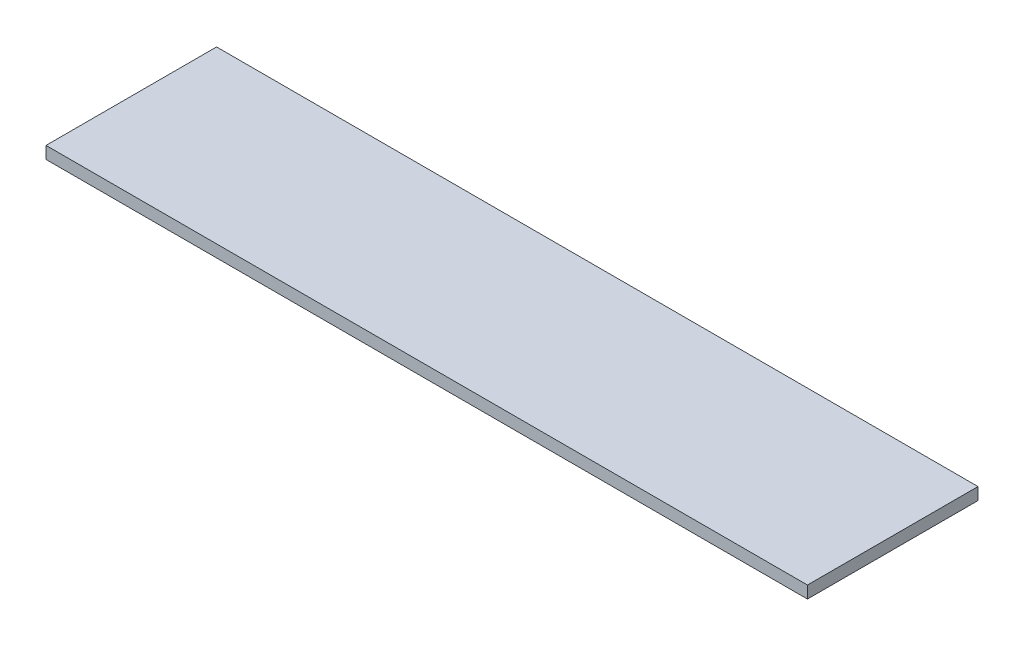
ISO-10303-21;
HEADER;
FILE_DESCRIPTION(('STEP AP214'),'2;1');
FILE_NAME('part.step','',(''),(''),'','','');
FILE_SCHEMA(('AUTOMOTIVE_DESIGN { 1 0 10303 214 1 1 1 1 }'));
ENDSEC;
DATA;
#1=APPLICATION_CONTEXT('core data for automotive mechanical design processes');
#2=APPLICATION_PROTOCOL_DEFINITION('international standard','automotive_design',2000,#1);
#3=PRODUCT_CONTEXT('',#1,'mechanical');
#4=PRODUCT('Part','Part','',(#3));
#5=PRODUCT_RELATED_PRODUCT_CATEGORY('part','',(#4));
#6=PRODUCT_DEFINITION_FORMATION('','',#4);
#7=PRODUCT_DEFINITION_CONTEXT('part definition',#1,'design');
#8=PRODUCT_DEFINITION('design','',#6,#7);
#9=PRODUCT_DEFINITION_SHAPE('','',#8);
#10=(LENGTH_UNIT() NAMED_UNIT(*) SI_UNIT(.MILLI.,.METRE.));
#11=(NAMED_UNIT(*) PLANE_ANGLE_UNIT() SI_UNIT($,.RADIAN.));
#12=(NAMED_UNIT(*) SI_UNIT($,.STERADIAN.) SOLID_ANGLE_UNIT());
#13=UNCERTAINTY_MEASURE_WITH_UNIT(LENGTH_MEASURE(1.E-05),#10,'distance_accuracy_value','');
#14=(GEOMETRIC_REPRESENTATION_CONTEXT(3) GLOBAL_UNCERTAINTY_ASSIGNED_CONTEXT((#13)) GLOBAL_UNIT_ASSIGNED_CONTEXT((#10,
#11,#12)) REPRESENTATION_CONTEXT('',''));
#15=CARTESIAN_POINT('',(0.,0.,0.));
#16=DIRECTION('',(0.,0.,1.));
#17=DIRECTION('',(1.,0.,0.));
#18=AXIS2_PLACEMENT_3D('',#15,#16,#17);
#19=CARTESIAN_POINT('',(-25.2200720695984,2.,-25.3921365703832));
#20=DIRECTION('',(1.,0.,0.));
#21=DIRECTION('',(0.,0.,-1.));
#22=AXIS2_PLACEMENT_3D('',#19,#20,#21);
#23=PLANE('',#22);
#24=DIRECTION('',(0.,0.,1.));
#25=VECTOR('',#24,1.);
#26=CARTESIAN_POINT('',(-25.2200720695984,0.,-25.3921365703832));
#27=LINE('',#26,#25);
#28=CARTESIAN_POINT('',(-25.2200720695984,0.,-25.3921365703832));
#29=VERTEX_POINT('',#28);
#30=CARTESIAN_POINT('',(-25.2200720695984,0.,2.60786342961676));
#31=VERTEX_POINT('',#30);
#32=EDGE_CURVE('E95',#29,#31,#27,.T.);
#33=ORIENTED_EDGE('',*,*,#32,.T.);
#34=DIRECTION('',(0.,-1.,0.));
#35=VECTOR('',#34,1.);
#36=CARTESIAN_POINT('',(-25.2200720695984,2.,2.60786342961676));
#37=LINE('',#36,#35);
#38=CARTESIAN_POINT('',(-25.2200720695984,2.,2.60786342961676));
#39=VERTEX_POINT('',#38);
#40=EDGE_CURVE('E11',#39,#31,#37,.T.);
#41=ORIENTED_EDGE('',*,*,#40,.F.);
#42=DIRECTION('',(0.,0.,1.));
#43=VECTOR('',#42,1.);
#44=CARTESIAN_POINT('',(-25.2200720695984,2.,-25.3921365703832));
#45=LINE('',#44,#43);
#46=CARTESIAN_POINT('',(-25.2200720695984,2.,-25.3921365703832));
#47=VERTEX_POINT('',#46);
#48=EDGE_CURVE('E83',#47,#39,#45,.T.);
#49=ORIENTED_EDGE('',*,*,#48,.F.);
#50=DIRECTION('',(0.,-1.,0.));
#51=VECTOR('',#50,1.);
#52=CARTESIAN_POINT('',(-25.2200720695984,2.,-25.3921365703832));
#53=LINE('',#52,#51);
#54=EDGE_CURVE('E91',#47,#29,#53,.T.);
#55=ORIENTED_EDGE('',*,*,#54,.T.);
#56=EDGE_LOOP('',(#33,#41,#49,#55));
#57=FACE_BOUND('',#56,.T.);
#58=ADVANCED_FACE('F32',(#57),#23,.F.);
#59=CARTESIAN_POINT('',(-25.2200720695984,2.,2.60786342961676));
#60=DIRECTION('',(0.,0.,-1.));
#61=DIRECTION('',(-1.,0.,0.));
#62=AXIS2_PLACEMENT_3D('',#59,#60,#61);
#63=PLANE('',#62);
#64=DIRECTION('',(1.,0.,0.));
#65=VECTOR('',#64,1.);
#66=CARTESIAN_POINT('',(-25.2200720695984,0.,2.60786342961676));
#67=LINE('',#66,#65);
#68=CARTESIAN_POINT('',(99.7799279304016,0.,2.60786342961676));
#69=VERTEX_POINT('',#68);
#70=EDGE_CURVE('E87',#31,#69,#67,.T.);
#71=ORIENTED_EDGE('',*,*,#70,.T.);
#72=DIRECTION('',(0.,-1.,0.));
#73=VECTOR('',#72,1.);
#74=CARTESIAN_POINT('',(99.7799279304016,2.,2.60786342961676));
#75=LINE('',#74,#73);
#76=CARTESIAN_POINT('',(99.7799279304016,2.,2.60786342961676));
#77=VERTEX_POINT('',#76);
#78=EDGE_CURVE('E40',#77,#69,#75,.T.);
#79=ORIENTED_EDGE('',*,*,#78,.F.);
#80=DIRECTION('',(1.,0.,0.));
#81=VECTOR('',#80,1.);
#82=CARTESIAN_POINT('',(-25.2200720695984,2.,2.60786342961676));
#83=LINE('',#82,#81);
#84=EDGE_CURVE('E78',#39,#77,#83,.T.);
#85=ORIENTED_EDGE('',*,*,#84,.F.);
#86=ORIENTED_EDGE('',*,*,#40,.T.);
#87=EDGE_LOOP('',(#71,#79,#85,#86));
#88=FACE_BOUND('',#87,.T.);
#89=ADVANCED_FACE('F86',(#88),#63,.F.);
#90=CARTESIAN_POINT('',(99.7799279304016,2.,-25.3921365703832));
#91=DIRECTION('',(-1.,0.,0.));
#92=DIRECTION('',(0.,0.,1.));
#93=AXIS2_PLACEMENT_3D('',#90,#91,#92);
#94=PLANE('',#93);
#95=DIRECTION('',(0.,0.,-1.));
#96=VECTOR('',#95,1.);
#97=CARTESIAN_POINT('',(99.7799279304016,0.,-25.3921365703832));
#98=LINE('',#97,#96);
#99=CARTESIAN_POINT('',(99.7799279304016,0.,-25.3921365703832));
#100=VERTEX_POINT('',#99);
#101=EDGE_CURVE('E65',#69,#100,#98,.T.);
#102=ORIENTED_EDGE('',*,*,#101,.T.);
#103=DIRECTION('',(0.,-1.,0.));
#104=VECTOR('',#103,1.);
#105=CARTESIAN_POINT('',(99.7799279304016,2.,-25.3921365703832));
#106=LINE('',#105,#104);
#107=CARTESIAN_POINT('',(99.7799279304016,2.,-25.3921365703832));
#108=VERTEX_POINT('',#107);
#109=EDGE_CURVE('E88',#108,#100,#106,.T.);
#110=ORIENTED_EDGE('',*,*,#109,.F.);
#111=DIRECTION('',(0.,0.,-1.));
#112=VECTOR('',#111,1.);
#113=CARTESIAN_POINT('',(99.7799279304016,2.,-25.3921365703832));
#114=LINE('',#113,#112);
#115=EDGE_CURVE('E81',#77,#108,#114,.T.);
#116=ORIENTED_EDGE('',*,*,#115,.F.);
#117=ORIENTED_EDGE('',*,*,#78,.T.);
#118=EDGE_LOOP('',(#102,#110,#116,#117));
#119=FACE_BOUND('',#118,.T.);
#120=ADVANCED_FACE('F89',(#119),#94,.F.);
#121=CARTESIAN_POINT('',(-25.2200720695984,2.,-25.3921365703832));
#122=DIRECTION('',(0.,0.,1.));
#123=DIRECTION('',(1.,0.,0.));
#124=AXIS2_PLACEMENT_3D('',#121,#122,#123);
#125=PLANE('',#124);
#126=DIRECTION('',(-1.,0.,0.));
#127=VECTOR('',#126,1.);
#128=CARTESIAN_POINT('',(-25.2200720695984,0.,-25.3921365703832));
#129=LINE('',#128,#127);
#130=EDGE_CURVE('E71',#100,#29,#129,.T.);
#131=ORIENTED_EDGE('',*,*,#130,.T.);
#132=ORIENTED_EDGE('',*,*,#54,.F.);
#133=DIRECTION('',(-1.,0.,0.));
#134=VECTOR('',#133,1.);
#135=CARTESIAN_POINT('',(-25.2200720695984,2.,-25.3921365703832));
#136=LINE('',#135,#134);
#137=EDGE_CURVE('E48',#108,#47,#136,.T.);
#138=ORIENTED_EDGE('',*,*,#137,.F.);
#139=ORIENTED_EDGE('',*,*,#109,.T.);
#140=EDGE_LOOP('',(#131,#132,#138,#139));
#141=FACE_BOUND('',#140,.T.);
#142=ADVANCED_FACE('F102',(#141),#125,.F.);
#143=CARTESIAN_POINT('',(0.,2.,0.));
#144=DIRECTION('',(0.,1.,0.));
#145=DIRECTION('',(0.,0.,1.));
#146=AXIS2_PLACEMENT_3D('',#143,#144,#145);
#147=PLANE('',#146);
#148=ORIENTED_EDGE('',*,*,#48,.T.);
#149=ORIENTED_EDGE('',*,*,#84,.T.);
#150=ORIENTED_EDGE('',*,*,#115,.T.);
#151=ORIENTED_EDGE('',*,*,#137,.T.);
#152=EDGE_LOOP('',(#148,#149,#150,#151));
#153=FACE_BOUND('',#152,.T.);
#154=ADVANCED_FACE('F79',(#153),#147,.T.);
#155=CARTESIAN_POINT('',(0.,0.,0.));
#156=DIRECTION('',(0.,1.,0.));
#157=DIRECTION('',(0.,0.,1.));
#158=AXIS2_PLACEMENT_3D('',#155,#156,#157);
#159=PLANE('',#158);
#160=ORIENTED_EDGE('',*,*,#32,.F.);
#161=ORIENTED_EDGE('',*,*,#130,.F.);
#162=ORIENTED_EDGE('',*,*,#101,.F.);
#163=ORIENTED_EDGE('',*,*,#70,.F.);
#164=EDGE_LOOP('',(#160,#161,#162,#163));
#165=FACE_BOUND('',#164,.T.);
#166=ADVANCED_FACE('F105',(#165),#159,.F.);
#167=CLOSED_SHELL('',(#58,#89,#120,#142,#154,#166));
#168=MANIFOLD_SOLID_BREP('B2',#167);
#169=ADVANCED_BREP_SHAPE_REPRESENTATION('',(#18,#168),#14);
#170=SHAPE_DEFINITION_REPRESENTATION(#9,#169);
ENDSEC;
END-ISO-10303-21;
